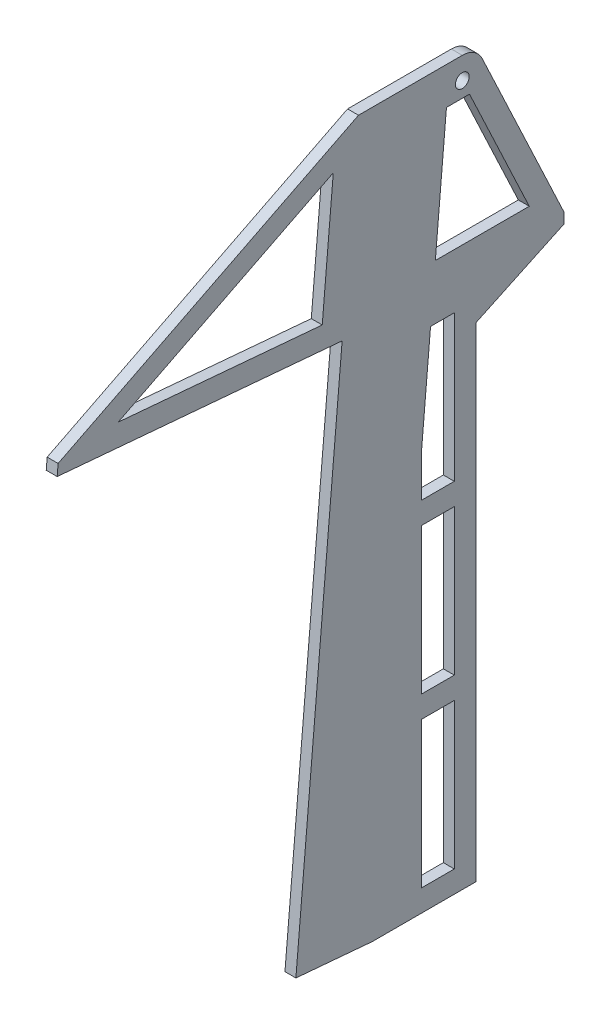
ISO-10303-21;
HEADER;
FILE_DESCRIPTION(('STEP AP214'),'2;1');
FILE_NAME('part.step','',(''),(''),'','','');
FILE_SCHEMA(('AUTOMOTIVE_DESIGN { 1 0 10303 214 1 1 1 1 }'));
ENDSEC;
DATA;
#1=APPLICATION_CONTEXT('core data for automotive mechanical design processes');
#2=APPLICATION_PROTOCOL_DEFINITION('international standard','automotive_design',2000,#1);
#3=PRODUCT_CONTEXT('',#1,'mechanical');
#4=PRODUCT('Part','Part','',(#3));
#5=PRODUCT_RELATED_PRODUCT_CATEGORY('part','',(#4));
#6=PRODUCT_DEFINITION_FORMATION('','',#4);
#7=PRODUCT_DEFINITION_CONTEXT('part definition',#1,'design');
#8=PRODUCT_DEFINITION('design','',#6,#7);
#9=PRODUCT_DEFINITION_SHAPE('','',#8);
#10=(LENGTH_UNIT() NAMED_UNIT(*) SI_UNIT(.MILLI.,.METRE.));
#11=(NAMED_UNIT(*) PLANE_ANGLE_UNIT() SI_UNIT($,.RADIAN.));
#12=(NAMED_UNIT(*) SI_UNIT($,.STERADIAN.) SOLID_ANGLE_UNIT());
#13=UNCERTAINTY_MEASURE_WITH_UNIT(LENGTH_MEASURE(1.E-05),#10,'distance_accuracy_value','');
#14=(GEOMETRIC_REPRESENTATION_CONTEXT(3) GLOBAL_UNCERTAINTY_ASSIGNED_CONTEXT((#13)) GLOBAL_UNIT_ASSIGNED_CONTEXT((#10,
#11,#12)) REPRESENTATION_CONTEXT('',''));
#15=CARTESIAN_POINT('',(0.,0.,0.));
#16=DIRECTION('',(0.,0.,1.));
#17=DIRECTION('',(1.,0.,0.));
#18=AXIS2_PLACEMENT_3D('',#15,#16,#17);
#19=CARTESIAN_POINT('',(6.35,419.1,-36.6664988837163));
#20=DIRECTION('',(0.,-1.,0.));
#21=DIRECTION('',(0.,0.,-1.));
#22=AXIS2_PLACEMENT_3D('',#19,#20,#21);
#23=PLANE('',#22);
#24=DIRECTION('',(0.,0.,1.));
#25=VECTOR('',#24,1.);
#26=CARTESIAN_POINT('',(6.35,419.1,-36.6664988837163));
#27=LINE('',#26,#25);
#28=CARTESIAN_POINT('',(6.35,419.1,-96.8631173548475));
#29=VERTEX_POINT('',#28);
#30=CARTESIAN_POINT('',(6.35,419.1,-36.6664988837163));
#31=VERTEX_POINT('',#30);
#32=EDGE_CURVE('E417',#29,#31,#27,.T.);
#33=ORIENTED_EDGE('',*,*,#32,.F.);
#34=DIRECTION('',(-1.,0.,0.));
#35=VECTOR('',#34,1.);
#36=CARTESIAN_POINT('',(6.35,419.1,-96.8631173548475));
#37=LINE('',#36,#35);
#38=CARTESIAN_POINT('',(0.,419.1,-96.8631173548475));
#39=VERTEX_POINT('',#38);
#40=EDGE_CURVE('E490',#29,#39,#37,.T.);
#41=ORIENTED_EDGE('',*,*,#40,.T.);
#42=DIRECTION('',(0.,0.,1.));
#43=VECTOR('',#42,1.);
#44=CARTESIAN_POINT('',(0.,419.1,-36.6664988837163));
#45=LINE('',#44,#43);
#46=CARTESIAN_POINT('',(0.,419.1,-36.6664988837163));
#47=VERTEX_POINT('',#46);
#48=EDGE_CURVE('E412',#39,#47,#45,.T.);
#49=ORIENTED_EDGE('',*,*,#48,.T.);
#50=DIRECTION('',(-1.,0.,0.));
#51=VECTOR('',#50,1.);
#52=CARTESIAN_POINT('',(6.35,419.1,-36.6664988837163));
#53=LINE('',#52,#51);
#54=EDGE_CURVE('E487',#31,#47,#53,.T.);
#55=ORIENTED_EDGE('',*,*,#54,.F.);
#56=EDGE_LOOP('',(#33,#41,#49,#55));
#57=FACE_BOUND('',#56,.T.);
#58=ADVANCED_FACE('F32',(#57),#23,.F.);
#59=CARTESIAN_POINT('',(6.35,331.297262379926,137.563755828843));
#60=DIRECTION('',(0.,-0.893013015148834,-0.450030837582036));
#61=DIRECTION('',(0.,0.450030837582036,-0.893013015148834));
#62=AXIS2_PLACEMENT_3D('',#59,#60,#61);
#63=PLANE('',#62);
#64=DIRECTION('',(0.,-0.450030837582036,0.893013015148834));
#65=VECTOR('',#64,1.);
#66=CARTESIAN_POINT('',(0.,331.297262379926,137.563755828843));
#67=LINE('',#66,#65);
#68=CARTESIAN_POINT('',(0.,331.297262379926,137.563755828843));
#69=VERTEX_POINT('',#68);
#70=EDGE_CURVE('E442',#47,#69,#67,.T.);
#71=ORIENTED_EDGE('',*,*,#70,.T.);
#72=DIRECTION('',(-1.,0.,0.));
#73=VECTOR('',#72,1.);
#74=CARTESIAN_POINT('',(6.35,331.297262379926,137.563755828843));
#75=LINE('',#74,#73);
#76=CARTESIAN_POINT('',(6.35,331.297262379926,137.563755828843));
#77=VERTEX_POINT('',#76);
#78=EDGE_CURVE('E484',#77,#69,#75,.T.);
#79=ORIENTED_EDGE('',*,*,#78,.F.);
#80=DIRECTION('',(0.,-0.450030837582036,0.893013015148834));
#81=VECTOR('',#80,1.);
#82=CARTESIAN_POINT('',(6.35,331.297262379926,137.563755828843));
#83=LINE('',#82,#81);
#84=EDGE_CURVE('E419',#31,#77,#83,.T.);
#85=ORIENTED_EDGE('',*,*,#84,.F.);
#86=ORIENTED_EDGE('',*,*,#54,.T.);
#87=EDGE_LOOP('',(#71,#79,#85,#86));
#88=FACE_BOUND('',#87,.T.);
#89=ADVANCED_FACE('F505',(#88),#63,.F.);
#90=CARTESIAN_POINT('',(6.35,324.971426047043,138.11719479529));
#91=DIRECTION('',(0.,-0.0871557427476588,-0.996194698091746));
#92=DIRECTION('',(0.,0.996194698091745,-0.0871557427476588));
#93=AXIS2_PLACEMENT_3D('',#90,#91,#92);
#94=PLANE('',#93);
#95=DIRECTION('',(0.,-0.996194698091745,0.0871557427476588));
#96=VECTOR('',#95,1.);
#97=CARTESIAN_POINT('',(0.,324.971426047043,138.11719479529));
#98=LINE('',#97,#96);
#99=CARTESIAN_POINT('',(0.,324.971426047043,138.11719479529));
#100=VERTEX_POINT('',#99);
#101=EDGE_CURVE('E444',#69,#100,#98,.T.);
#102=ORIENTED_EDGE('',*,*,#101,.T.);
#103=DIRECTION('',(-1.,0.,0.));
#104=VECTOR('',#103,1.);
#105=CARTESIAN_POINT('',(6.35,324.971426047043,138.11719479529));
#106=LINE('',#105,#104);
#107=CARTESIAN_POINT('',(6.35,324.971426047043,138.11719479529));
#108=VERTEX_POINT('',#107);
#109=EDGE_CURVE('E481',#108,#100,#106,.T.);
#110=ORIENTED_EDGE('',*,*,#109,.F.);
#111=DIRECTION('',(0.,-0.996194698091745,0.0871557427476588));
#112=VECTOR('',#111,1.);
#113=CARTESIAN_POINT('',(6.35,324.971426047043,138.11719479529));
#114=LINE('',#113,#112);
#115=EDGE_CURVE('E422',#77,#108,#114,.T.);
#116=ORIENTED_EDGE('',*,*,#115,.F.);
#117=ORIENTED_EDGE('',*,*,#78,.T.);
#118=EDGE_LOOP('',(#102,#110,#116,#117));
#119=FACE_BOUND('',#118,.T.);
#120=ADVANCED_FACE('F524',(#119),#94,.F.);
#121=CARTESIAN_POINT('',(6.35,324.971426047043,138.11719479529));
#122=DIRECTION('',(0.,0.996194698091745,-0.0871557427476613));
#123=DIRECTION('',(0.,0.0871557427476614,0.996194698091745));
#124=AXIS2_PLACEMENT_3D('',#121,#122,#123);
#125=PLANE('',#124);
#126=DIRECTION('',(0.,-0.0871557427476613,-0.996194698091745));
#127=VECTOR('',#126,1.);
#128=CARTESIAN_POINT('',(0.,324.971426047043,138.11719479529));
#129=LINE('',#128,#127);
#130=CARTESIAN_POINT('',(0.,310.511003372466,-27.1661926951519));
#131=VERTEX_POINT('',#130);
#132=EDGE_CURVE('E446',#100,#131,#129,.T.);
#133=ORIENTED_EDGE('',*,*,#132,.T.);
#134=DIRECTION('',(-1.,0.,0.));
#135=VECTOR('',#134,1.);
#136=CARTESIAN_POINT('',(6.35,310.511003372466,-27.1661926951519));
#137=LINE('',#136,#135);
#138=CARTESIAN_POINT('',(6.35,310.511003372466,-27.1661926951519));
#139=VERTEX_POINT('',#138);
#140=EDGE_CURVE('E478',#139,#131,#137,.T.);
#141=ORIENTED_EDGE('',*,*,#140,.F.);
#142=DIRECTION('',(0.,-0.0871557427476613,-0.996194698091745));
#143=VECTOR('',#142,1.);
#144=CARTESIAN_POINT('',(6.35,324.971426047043,138.11719479529));
#145=LINE('',#144,#143);
#146=EDGE_CURVE('E424',#108,#139,#145,.T.);
#147=ORIENTED_EDGE('',*,*,#146,.F.);
#148=ORIENTED_EDGE('',*,*,#109,.T.);
#149=EDGE_LOOP('',(#133,#141,#147,#148));
#150=FACE_BOUND('',#149,.T.);
#151=ADVANCED_FACE('F529',(#150),#125,.F.);
#152=CARTESIAN_POINT('',(6.35,310.511003372466,-27.1661926951519));
#153=DIRECTION('',(0.,-0.0871557427476619,-0.996194698091745));
#154=DIRECTION('',(0.,0.996194698091745,-0.0871557427476619));
#155=AXIS2_PLACEMENT_3D('',#152,#153,#154);
#156=PLANE('',#155);
#157=DIRECTION('',(0.,-0.996194698091745,0.0871557427476619));
#158=VECTOR('',#157,1.);
#159=CARTESIAN_POINT('',(0.,310.511003372466,-27.1661926951519));
#160=LINE('',#159,#158);
#161=CARTESIAN_POINT('',(0.,3.8740727651336,-0.338937448623741));
#162=VERTEX_POINT('',#161);
#163=EDGE_CURVE('E448',#131,#162,#160,.T.);
#164=ORIENTED_EDGE('',*,*,#163,.T.);
#165=DIRECTION('',(-1.,0.,0.));
#166=VECTOR('',#165,1.);
#167=CARTESIAN_POINT('',(6.35,3.8740727651336,-0.338937448623741));
#168=LINE('',#167,#166);
#169=CARTESIAN_POINT('',(6.35,3.8740727651336,-0.338937448623741));
#170=VERTEX_POINT('',#169);
#171=EDGE_CURVE('E475',#170,#162,#168,.T.);
#172=ORIENTED_EDGE('',*,*,#171,.F.);
#173=DIRECTION('',(0.,-0.996194698091745,0.0871557427476619));
#174=VECTOR('',#173,1.);
#175=CARTESIAN_POINT('',(6.35,310.511003372466,-27.1661926951519));
#176=LINE('',#175,#174);
#177=EDGE_CURVE('E426',#139,#170,#176,.T.);
#178=ORIENTED_EDGE('',*,*,#177,.F.);
#179=ORIENTED_EDGE('',*,*,#140,.T.);
#180=EDGE_LOOP('',(#164,#172,#178,#179));
#181=FACE_BOUND('',#180,.T.);
#182=ADVANCED_FACE('F533',(#181),#156,.F.);
#183=CARTESIAN_POINT('',(6.35,3.8740727651336,-0.338937448623741));
#184=DIRECTION('',(0.,0.996194698091745,-0.087155742747662));
#185=DIRECTION('',(0.,0.087155742747662,0.996194698091745));
#186=AXIS2_PLACEMENT_3D('',#183,#184,#185);
#187=PLANE('',#186);
#188=DIRECTION('',(0.,-0.087155742747662,-0.996194698091745));
#189=VECTOR('',#188,1.);
#190=CARTESIAN_POINT('',(0.,3.8740727651336,-0.338937448623741));
#191=LINE('',#190,#189);
#192=CARTESIAN_POINT('',(0.,0.,-44.6197917788018));
#193=VERTEX_POINT('',#192);
#194=EDGE_CURVE('E450',#162,#193,#191,.T.);
#195=ORIENTED_EDGE('',*,*,#194,.T.);
#196=DIRECTION('',(-1.,0.,0.));
#197=VECTOR('',#196,1.);
#198=CARTESIAN_POINT('',(6.35,0.,-44.6197917788018));
#199=LINE('',#198,#197);
#200=CARTESIAN_POINT('',(6.35,0.,-44.6197917788018));
#201=VERTEX_POINT('',#200);
#202=EDGE_CURVE('E472',#201,#193,#199,.T.);
#203=ORIENTED_EDGE('',*,*,#202,.F.);
#204=DIRECTION('',(0.,-0.087155742747662,-0.996194698091745));
#205=VECTOR('',#204,1.);
#206=CARTESIAN_POINT('',(6.35,3.8740727651336,-0.338937448623741));
#207=LINE('',#206,#205);
#208=EDGE_CURVE('E428',#170,#201,#207,.T.);
#209=ORIENTED_EDGE('',*,*,#208,.F.);
#210=ORIENTED_EDGE('',*,*,#171,.T.);
#211=EDGE_LOOP('',(#195,#203,#209,#210));
#212=FACE_BOUND('',#211,.T.);
#213=ADVANCED_FACE('F537',(#212),#187,.F.);
#214=CARTESIAN_POINT('',(6.35,0.,-44.6197917788018));
#215=DIRECTION('',(0.,1.,0.));
#216=DIRECTION('',(0.,0.,1.));
#217=AXIS2_PLACEMENT_3D('',#214,#215,#216);
#218=PLANE('',#217);
#219=DIRECTION('',(0.,0.,-1.));
#220=VECTOR('',#219,1.);
#221=CARTESIAN_POINT('',(0.,0.,-44.6197917788018));
#222=LINE('',#221,#220);
#223=CARTESIAN_POINT('',(0.,0.,-104.922607748748));
#224=VERTEX_POINT('',#223);
#225=EDGE_CURVE('E452',#193,#224,#222,.T.);
#226=ORIENTED_EDGE('',*,*,#225,.T.);
#227=DIRECTION('',(-1.,0.,0.));
#228=VECTOR('',#227,1.);
#229=CARTESIAN_POINT('',(6.35,0.,-104.922607748748));
#230=LINE('',#229,#228);
#231=CARTESIAN_POINT('',(6.35,0.,-104.922607748748));
#232=VERTEX_POINT('',#231);
#233=EDGE_CURVE('E469',#232,#224,#230,.T.);
#234=ORIENTED_EDGE('',*,*,#233,.F.);
#235=DIRECTION('',(0.,0.,-1.));
#236=VECTOR('',#235,1.);
#237=CARTESIAN_POINT('',(6.35,0.,-44.6197917788018));
#238=LINE('',#237,#236);
#239=EDGE_CURVE('E430',#201,#232,#238,.T.);
#240=ORIENTED_EDGE('',*,*,#239,.F.);
#241=ORIENTED_EDGE('',*,*,#202,.T.);
#242=EDGE_LOOP('',(#226,#234,#240,#241));
#243=FACE_BOUND('',#242,.T.);
#244=ADVANCED_FACE('F541',(#243),#218,.F.);
#245=CARTESIAN_POINT('',(6.35,280.894117647059,-104.922607748748));
#246=DIRECTION('',(0.,0.,1.));
#247=DIRECTION('',(0.,-1.,0.));
#248=AXIS2_PLACEMENT_3D('',#245,#246,#247);
#249=PLANE('',#248);
#250=DIRECTION('',(0.,1.,0.));
#251=VECTOR('',#250,1.);
#252=CARTESIAN_POINT('',(0.,280.894117647059,-104.922607748748));
#253=LINE('',#252,#251);
#254=CARTESIAN_POINT('',(0.,280.894117647059,-104.922607748748));
#255=VERTEX_POINT('',#254);
#256=EDGE_CURVE('E454',#224,#255,#253,.T.);
#257=ORIENTED_EDGE('',*,*,#256,.T.);
#258=DIRECTION('',(-1.,0.,0.));
#259=VECTOR('',#258,1.);
#260=CARTESIAN_POINT('',(6.35,280.894117647059,-104.922607748748));
#261=LINE('',#260,#259);
#262=CARTESIAN_POINT('',(6.35,280.894117647059,-104.922607748748));
#263=VERTEX_POINT('',#262);
#264=EDGE_CURVE('E466',#263,#255,#261,.T.);
#265=ORIENTED_EDGE('',*,*,#264,.F.);
#266=DIRECTION('',(0.,1.,0.));
#267=VECTOR('',#266,1.);
#268=CARTESIAN_POINT('',(6.35,280.894117647059,-104.922607748748));
#269=LINE('',#268,#267);
#270=EDGE_CURVE('E432',#232,#263,#269,.T.);
#271=ORIENTED_EDGE('',*,*,#270,.F.);
#272=ORIENTED_EDGE('',*,*,#233,.T.);
#273=EDGE_LOOP('',(#257,#265,#271,#272));
#274=FACE_BOUND('',#273,.T.);
#275=ADVANCED_FACE('F545',(#274),#249,.F.);
#276=CARTESIAN_POINT('',(6.35,304.8,-155.722607748748));
#277=DIRECTION('',(0.,0.904818702200994,0.425797036329879));
#278=DIRECTION('',(0.,-0.425797036329879,0.904818702200994));
#279=AXIS2_PLACEMENT_3D('',#276,#277,#278);
#280=PLANE('',#279);
#281=DIRECTION('',(0.,0.42579703632988,-0.904818702200994));
#282=VECTOR('',#281,1.);
#283=CARTESIAN_POINT('',(0.,304.8,-155.722607748748));
#284=LINE('',#283,#282);
#285=CARTESIAN_POINT('',(0.,304.8,-155.722607748748));
#286=VERTEX_POINT('',#285);
#287=EDGE_CURVE('E456',#255,#286,#284,.T.);
#288=ORIENTED_EDGE('',*,*,#287,.T.);
#289=DIRECTION('',(-1.,0.,0.));
#290=VECTOR('',#289,1.);
#291=CARTESIAN_POINT('',(6.35,304.8,-155.722607748748));
#292=LINE('',#291,#290);
#293=CARTESIAN_POINT('',(6.35,304.8,-155.722607748748));
#294=VERTEX_POINT('',#293);
#295=EDGE_CURVE('E463',#294,#286,#292,.T.);
#296=ORIENTED_EDGE('',*,*,#295,.F.);
#297=DIRECTION('',(0.,0.42579703632988,-0.904818702200994));
#298=VECTOR('',#297,1.);
#299=CARTESIAN_POINT('',(6.35,304.8,-155.722607748748));
#300=LINE('',#299,#298);
#301=EDGE_CURVE('E434',#263,#294,#300,.T.);
#302=ORIENTED_EDGE('',*,*,#301,.F.);
#303=ORIENTED_EDGE('',*,*,#264,.T.);
#304=EDGE_LOOP('',(#288,#296,#302,#303));
#305=FACE_BOUND('',#304,.T.);
#306=ADVANCED_FACE('F549',(#305),#280,.F.);
#307=CARTESIAN_POINT('',(6.35,311.15,-155.722607748748));
#308=DIRECTION('',(0.,0.,1.));
#309=DIRECTION('',(1.,0.,0.));
#310=AXIS2_PLACEMENT_3D('',#307,#308,#309);
#311=PLANE('',#310);
#312=DIRECTION('',(0.,1.,0.));
#313=VECTOR('',#312,1.);
#314=CARTESIAN_POINT('',(0.,311.15,-155.722607748748));
#315=LINE('',#314,#313);
#316=CARTESIAN_POINT('',(0.,311.15,-155.722607748748));
#317=VERTEX_POINT('',#316);
#318=EDGE_CURVE('E458',#286,#317,#315,.T.);
#319=ORIENTED_EDGE('',*,*,#318,.T.);
#320=DIRECTION('',(-1.,0.,0.));
#321=VECTOR('',#320,1.);
#322=CARTESIAN_POINT('',(6.35,311.15,-155.722607748748));
#323=LINE('',#322,#321);
#324=CARTESIAN_POINT('',(6.35,311.15,-155.722607748748));
#325=VERTEX_POINT('',#324);
#326=EDGE_CURVE('E440',#325,#317,#323,.T.);
#327=ORIENTED_EDGE('',*,*,#326,.F.);
#328=DIRECTION('',(0.,1.,0.));
#329=VECTOR('',#328,1.);
#330=CARTESIAN_POINT('',(6.35,311.15,-155.722607748748));
#331=LINE('',#330,#329);
#332=EDGE_CURVE('E436',#294,#325,#331,.T.);
#333=ORIENTED_EDGE('',*,*,#332,.F.);
#334=ORIENTED_EDGE('',*,*,#295,.T.);
#335=EDGE_LOOP('',(#319,#327,#333,#334));
#336=FACE_BOUND('',#335,.T.);
#337=ADVANCED_FACE('F553',(#336),#311,.F.);
#338=CARTESIAN_POINT('',(6.35,419.1,-104.922607748748));
#339=DIRECTION('',(0.,-0.42579703632988,0.904818702200994));
#340=DIRECTION('',(0.,-0.904818702200994,-0.42579703632988));
#341=AXIS2_PLACEMENT_3D('',#338,#339,#340);
#342=PLANE('',#341);
#343=DIRECTION('',(0.,0.904818702200994,0.42579703632988));
#344=VECTOR('',#343,1.);
#345=CARTESIAN_POINT('',(0.,419.1,-104.922607748748));
#346=LINE('',#345,#344);
#347=CARTESIAN_POINT('',(0.,411.807622361389,-108.3543148728));
#348=VERTEX_POINT('',#347);
#349=EDGE_CURVE('E420',#317,#348,#346,.T.);
#350=ORIENTED_EDGE('',*,*,#349,.T.);
#351=DIRECTION('',(-1.,0.,0.));
#352=VECTOR('',#351,1.);
#353=CARTESIAN_POINT('',(6.35,411.807622361389,-108.3543148728));
#354=LINE('',#353,#352);
#355=CARTESIAN_POINT('',(6.35,411.807622361389,-108.3543148728));
#356=VERTEX_POINT('',#355);
#357=EDGE_CURVE('E40',#348,#356,#354,.F.);
#358=ORIENTED_EDGE('',*,*,#357,.T.);
#359=DIRECTION('',(0.,0.904818702200994,0.42579703632988));
#360=VECTOR('',#359,1.);
#361=CARTESIAN_POINT('',(6.35,419.1,-104.922607748748));
#362=LINE('',#361,#360);
#363=EDGE_CURVE('E438',#325,#356,#362,.T.);
#364=ORIENTED_EDGE('',*,*,#363,.F.);
#365=ORIENTED_EDGE('',*,*,#326,.T.);
#366=EDGE_LOOP('',(#350,#358,#364,#365));
#367=FACE_BOUND('',#366,.T.);
#368=ADVANCED_FACE('F557',(#367),#342,.F.);
#369=CARTESIAN_POINT('',(6.35,0.,0.));
#370=DIRECTION('',(-1.,0.,0.));
#371=DIRECTION('',(0.,0.,1.));
#372=AXIS2_PLACEMENT_3D('',#369,#370,#371);
#373=PLANE('',#372);
#374=CARTESIAN_POINT('',(6.35,406.4,-96.8631173548475));
#375=DIRECTION('',(1.,0.,0.));
#376=DIRECTION('',(0.,0.,-1.));
#377=AXIS2_PLACEMENT_3D('',#374,#375,#376);
#378=CIRCLE('',#377,4.00000000000001);
#379=CARTESIAN_POINT('',(6.35,406.4,-100.863117354848));
#380=VERTEX_POINT('',#379);
#381=EDGE_CURVE('E272',#380,#380,#378,.T.);
#382=ORIENTED_EDGE('',*,*,#381,.F.);
#383=EDGE_LOOP('',(#382));
#384=FACE_BOUND('',#383,.T.);
#385=DIRECTION('',(0.,-0.996194698091745,0.0871557427476616));
#386=VECTOR('',#385,1.);
#387=CARTESIAN_POINT('',(6.35,397.501651207452,-87.6781936520239));
#388=LINE('',#387,#386);
#389=CARTESIAN_POINT('',(6.35,397.501651207452,-87.6781936520239));
#390=VERTEX_POINT('',#389);
#391=CARTESIAN_POINT('',(6.35,323.85,-81.2345091214061));
#392=VERTEX_POINT('',#391);
#393=EDGE_CURVE('E278',#390,#392,#388,.T.);
#394=ORIENTED_EDGE('',*,*,#393,.F.);
#395=DIRECTION('',(0.,0.,1.));
#396=VECTOR('',#395,1.);
#397=CARTESIAN_POINT('',(6.35,397.501651207452,-101.050575610164));
#398=LINE('',#397,#396);
#399=CARTESIAN_POINT('',(6.35,397.501651207452,-101.050575610164));
#400=VERTEX_POINT('',#399);
#401=EDGE_CURVE('E248',#400,#390,#398,.T.);
#402=ORIENTED_EDGE('',*,*,#401,.F.);
#403=DIRECTION('',(0.,0.904818702200994,0.42579703632988));
#404=VECTOR('',#403,1.);
#405=CARTESIAN_POINT('',(6.35,323.85,-135.710176178377));
#406=LINE('',#405,#404);
#407=CARTESIAN_POINT('',(6.35,323.85,-135.710176178377));
#408=VERTEX_POINT('',#407);
#409=EDGE_CURVE('E266',#408,#400,#406,.T.);
#410=ORIENTED_EDGE('',*,*,#409,.F.);
#411=DIRECTION('',(0.,0.,-1.));
#412=VECTOR('',#411,1.);
#413=CARTESIAN_POINT('',(6.35,323.85,-81.2345091214061));
#414=LINE('',#413,#412);
#415=EDGE_CURVE('E269',#392,#408,#414,.T.);
#416=ORIENTED_EDGE('',*,*,#415,.F.);
#417=EDGE_LOOP('',(#394,#402,#410,#416));
#418=FACE_BOUND('',#417,.T.);
#419=DIRECTION('',(0.,-1.,0.));
#420=VECTOR('',#419,1.);
#421=CARTESIAN_POINT('',(6.35,12.7,-73.1726077487484));
#422=LINE('',#421,#420);
#423=CARTESIAN_POINT('',(6.35,97.3666666666667,-73.1726077487484));
#424=VERTEX_POINT('',#423);
#425=CARTESIAN_POINT('',(6.35,12.7,-73.1726077487484));
#426=VERTEX_POINT('',#425);
#427=EDGE_CURVE('E304',#424,#426,#422,.T.);
#428=ORIENTED_EDGE('',*,*,#427,.F.);
#429=DIRECTION('',(0.,0.,1.));
#430=VECTOR('',#429,1.);
#431=CARTESIAN_POINT('',(6.35,97.3666666666667,-73.1726077487484));
#432=LINE('',#431,#430);
#433=CARTESIAN_POINT('',(6.35,97.3666666666667,-92.2226077487481));
#434=VERTEX_POINT('',#433);
#435=EDGE_CURVE('E285',#434,#424,#432,.T.);
#436=ORIENTED_EDGE('',*,*,#435,.F.);
#437=DIRECTION('',(0.,1.,0.));
#438=VECTOR('',#437,1.);
#439=CARTESIAN_POINT('',(6.35,97.3666666666667,-92.2226077487481));
#440=LINE('',#439,#438);
#441=CARTESIAN_POINT('',(6.35,12.7,-92.2226077487482));
#442=VERTEX_POINT('',#441);
#443=EDGE_CURVE('E293',#442,#434,#440,.T.);
#444=ORIENTED_EDGE('',*,*,#443,.F.);
#445=DIRECTION('',(0.,0.,-1.));
#446=VECTOR('',#445,1.);
#447=CARTESIAN_POINT('',(6.35,12.7,-92.2226077487482));
#448=LINE('',#447,#446);
#449=EDGE_CURVE('E307',#426,#442,#448,.T.);
#450=ORIENTED_EDGE('',*,*,#449,.F.);
#451=EDGE_LOOP('',(#428,#436,#444,#450));
#452=FACE_BOUND('',#451,.T.);
#453=DIRECTION('',(0.,-1.,0.));
#454=VECTOR('',#453,1.);
#455=CARTESIAN_POINT('',(6.35,110.066666666667,-73.1726077487484));
#456=LINE('',#455,#454);
#457=CARTESIAN_POINT('',(6.35,194.733333333333,-73.1726077487484));
#458=VERTEX_POINT('',#457);
#459=CARTESIAN_POINT('',(6.35,110.066666666667,-73.1726077487484));
#460=VERTEX_POINT('',#459);
#461=EDGE_CURVE('E336',#458,#460,#456,.T.);
#462=ORIENTED_EDGE('',*,*,#461,.F.);
#463=DIRECTION('',(0.,0.,1.));
#464=VECTOR('',#463,1.);
#465=CARTESIAN_POINT('',(6.35,194.733333333333,-73.1726077487484));
#466=LINE('',#465,#464);
#467=CARTESIAN_POINT('',(6.35,194.733333333333,-92.2226077487481));
#468=VERTEX_POINT('',#467);
#469=EDGE_CURVE('E314',#468,#458,#466,.T.);
#470=ORIENTED_EDGE('',*,*,#469,.F.);
#471=DIRECTION('',(0.,1.,0.));
#472=VECTOR('',#471,1.);
#473=CARTESIAN_POINT('',(6.35,194.733333333333,-92.2226077487481));
#474=LINE('',#473,#472);
#475=CARTESIAN_POINT('',(6.35,110.066666666667,-92.2226077487481));
#476=VERTEX_POINT('',#475);
#477=EDGE_CURVE('E325',#476,#468,#474,.T.);
#478=ORIENTED_EDGE('',*,*,#477,.F.);
#479=DIRECTION('',(0.,0.,-1.));
#480=VECTOR('',#479,1.);
#481=CARTESIAN_POINT('',(6.35,110.066666666667,-92.2226077487481));
#482=LINE('',#481,#480);
#483=EDGE_CURVE('E339',#460,#476,#482,.T.);
#484=ORIENTED_EDGE('',*,*,#483,.F.);
#485=EDGE_LOOP('',(#462,#470,#478,#484));
#486=FACE_BOUND('',#485,.T.);
#487=DIRECTION('',(0.,-0.996194698091745,0.0871557427476619));
#488=VECTOR('',#487,1.);
#489=CARTESIAN_POINT('',(6.35,292.1,-78.4567440544579));
#490=LINE('',#489,#488);
#491=CARTESIAN_POINT('',(6.35,292.1,-78.4567440544579));
#492=VERTEX_POINT('',#491);
#493=CARTESIAN_POINT('',(6.35,231.702045650823,-73.1726077487484));
#494=VERTEX_POINT('',#493);
#495=EDGE_CURVE('E371',#492,#494,#490,.T.);
#496=ORIENTED_EDGE('',*,*,#495,.F.);
#497=DIRECTION('',(0.,0.,1.));
#498=VECTOR('',#497,1.);
#499=CARTESIAN_POINT('',(6.35,292.1,-92.2226077487481));
#500=LINE('',#499,#498);
#501=CARTESIAN_POINT('',(6.35,292.1,-92.2226077487481));
#502=VERTEX_POINT('',#501);
#503=EDGE_CURVE('E346',#502,#492,#500,.T.);
#504=ORIENTED_EDGE('',*,*,#503,.F.);
#505=DIRECTION('',(0.,1.,0.));
#506=VECTOR('',#505,1.);
#507=CARTESIAN_POINT('',(6.35,207.433333333333,-92.2226077487481));
#508=LINE('',#507,#506);
#509=CARTESIAN_POINT('',(6.35,207.433333333333,-92.2226077487481));
#510=VERTEX_POINT('',#509);
#511=EDGE_CURVE('E357',#510,#502,#508,.T.);
#512=ORIENTED_EDGE('',*,*,#511,.F.);
#513=DIRECTION('',(0.,0.,-1.));
#514=VECTOR('',#513,1.);
#515=CARTESIAN_POINT('',(6.35,207.433333333333,-73.1726077487484));
#516=LINE('',#515,#514);
#517=CARTESIAN_POINT('',(6.35,207.433333333333,-73.1726077487484));
#518=VERTEX_POINT('',#517);
#519=EDGE_CURVE('E377',#518,#510,#516,.T.);
#520=ORIENTED_EDGE('',*,*,#519,.F.);
#521=DIRECTION('',(0.,-1.,0.));
#522=VECTOR('',#521,1.);
#523=CARTESIAN_POINT('',(6.35,231.702045650823,-73.1726077487484));
#524=LINE('',#523,#522);
#525=EDGE_CURVE('E374',#494,#518,#524,.T.);
#526=ORIENTED_EDGE('',*,*,#525,.F.);
#527=EDGE_LOOP('',(#496,#504,#512,#520,#526));
#528=FACE_BOUND('',#527,.T.);
#529=DIRECTION('',(0.,0.996194698091745,-0.087155742747662));
#530=VECTOR('',#529,1.);
#531=CARTESIAN_POINT('',(6.35,397.501651207452,-22.028376276689));
#532=LINE('',#531,#530);
#533=CARTESIAN_POINT('',(6.35,324.269553971127,-15.6213979622821));
#534=VERTEX_POINT('',#533);
#535=CARTESIAN_POINT('',(6.35,397.501651207452,-22.028376276689));
#536=VERTEX_POINT('',#535);
#537=EDGE_CURVE('E405',#534,#536,#532,.T.);
#538=ORIENTED_EDGE('',*,*,#537,.F.);
#539=DIRECTION('',(0.,-0.0871557427476612,-0.996194698091745));
#540=VECTOR('',#539,1.);
#541=CARTESIAN_POINT('',(6.35,324.269553971127,-15.6213979622821));
#542=LINE('',#541,#540);
#543=CARTESIAN_POINT('',(6.35,334.624867422538,102.740376398826));
#544=VERTEX_POINT('',#543);
#545=EDGE_CURVE('E384',#544,#534,#542,.T.);
#546=ORIENTED_EDGE('',*,*,#545,.F.);
#547=DIRECTION('',(0.,-0.450030837582036,0.893013015148834));
#548=VECTOR('',#547,1.);
#549=CARTESIAN_POINT('',(6.35,334.624867422538,102.740376398826));
#550=LINE('',#549,#548);
#551=EDGE_CURVE('E397',#536,#544,#550,.T.);
#552=ORIENTED_EDGE('',*,*,#551,.F.);
#553=EDGE_LOOP('',(#538,#546,#552));
#554=FACE_BOUND('',#553,.T.);
#555=ORIENTED_EDGE('',*,*,#363,.T.);
#556=CARTESIAN_POINT('',(6.35,406.4,-96.8631173548475));
#557=DIRECTION('',(-1.,0.,0.));
#558=DIRECTION('',(0.,0.,1.));
#559=AXIS2_PLACEMENT_3D('',#556,#557,#558);
#560=CIRCLE('',#559,12.7);
#561=EDGE_CURVE('E11',#356,#29,#560,.F.);
#562=ORIENTED_EDGE('',*,*,#561,.T.);
#563=ORIENTED_EDGE('',*,*,#32,.T.);
#564=ORIENTED_EDGE('',*,*,#84,.T.);
#565=ORIENTED_EDGE('',*,*,#115,.T.);
#566=ORIENTED_EDGE('',*,*,#146,.T.);
#567=ORIENTED_EDGE('',*,*,#177,.T.);
#568=ORIENTED_EDGE('',*,*,#208,.T.);
#569=ORIENTED_EDGE('',*,*,#239,.T.);
#570=ORIENTED_EDGE('',*,*,#270,.T.);
#571=ORIENTED_EDGE('',*,*,#301,.T.);
#572=ORIENTED_EDGE('',*,*,#332,.T.);
#573=EDGE_LOOP('',(#555,#562,#563,#564,#565,#566,#567,#568,#569,#570,#571,#572));
#574=FACE_BOUND('',#573,.T.);
#575=ADVANCED_FACE('F508',(#384,#418,#452,#486,#528,#554,#574),#373,.F.);
#576=CARTESIAN_POINT('',(0.,0.,0.));
#577=DIRECTION('',(-1.,0.,0.));
#578=DIRECTION('',(0.,0.,1.));
#579=AXIS2_PLACEMENT_3D('',#576,#577,#578);
#580=PLANE('',#579);
#581=CARTESIAN_POINT('',(0.,406.4,-96.8631173548475));
#582=DIRECTION('',(1.,0.,0.));
#583=DIRECTION('',(0.,0.,-1.));
#584=AXIS2_PLACEMENT_3D('',#581,#582,#583);
#585=CIRCLE('',#584,4.00000000000001);
#586=CARTESIAN_POINT('',(0.,406.4,-100.863117354848));
#587=VERTEX_POINT('',#586);
#588=EDGE_CURVE('E279',#587,#587,#585,.T.);
#589=ORIENTED_EDGE('',*,*,#588,.T.);
#590=EDGE_LOOP('',(#589));
#591=FACE_BOUND('',#590,.T.);
#592=DIRECTION('',(0.,0.,1.));
#593=VECTOR('',#592,1.);
#594=CARTESIAN_POINT('',(0.,397.501651207452,-101.050575610164));
#595=LINE('',#594,#593);
#596=CARTESIAN_POINT('',(0.,397.501651207452,-101.050575610164));
#597=VERTEX_POINT('',#596);
#598=CARTESIAN_POINT('',(0.,397.501651207452,-87.6781936520239));
#599=VERTEX_POINT('',#598);
#600=EDGE_CURVE('E245',#597,#599,#595,.T.);
#601=ORIENTED_EDGE('',*,*,#600,.T.);
#602=DIRECTION('',(0.,-0.996194698091745,0.0871557427476616));
#603=VECTOR('',#602,1.);
#604=CARTESIAN_POINT('',(0.,397.501651207452,-87.6781936520239));
#605=LINE('',#604,#603);
#606=CARTESIAN_POINT('',(0.,323.85,-81.2345091214061));
#607=VERTEX_POINT('',#606);
#608=EDGE_CURVE('E257',#599,#607,#605,.T.);
#609=ORIENTED_EDGE('',*,*,#608,.T.);
#610=DIRECTION('',(0.,0.,-1.));
#611=VECTOR('',#610,1.);
#612=CARTESIAN_POINT('',(0.,323.85,-81.2345091214061));
#613=LINE('',#612,#611);
#614=CARTESIAN_POINT('',(0.,323.85,-135.710176178377));
#615=VERTEX_POINT('',#614);
#616=EDGE_CURVE('E261',#607,#615,#613,.T.);
#617=ORIENTED_EDGE('',*,*,#616,.T.);
#618=DIRECTION('',(0.,0.904818702200994,0.42579703632988));
#619=VECTOR('',#618,1.);
#620=CARTESIAN_POINT('',(0.,323.85,-135.710176178377));
#621=LINE('',#620,#619);
#622=EDGE_CURVE('E253',#615,#597,#621,.T.);
#623=ORIENTED_EDGE('',*,*,#622,.T.);
#624=EDGE_LOOP('',(#601,#609,#617,#623));
#625=FACE_BOUND('',#624,.T.);
#626=DIRECTION('',(0.,0.,1.));
#627=VECTOR('',#626,1.);
#628=CARTESIAN_POINT('',(0.,97.3666666666667,-73.1726077487484));
#629=LINE('',#628,#627);
#630=CARTESIAN_POINT('',(0.,97.3666666666667,-92.2226077487481));
#631=VERTEX_POINT('',#630);
#632=CARTESIAN_POINT('',(0.,97.3666666666667,-73.1726077487484));
#633=VERTEX_POINT('',#632);
#634=EDGE_CURVE('E289',#631,#633,#629,.T.);
#635=ORIENTED_EDGE('',*,*,#634,.T.);
#636=DIRECTION('',(0.,-1.,0.));
#637=VECTOR('',#636,1.);
#638=CARTESIAN_POINT('',(0.,12.7,-73.1726077487484));
#639=LINE('',#638,#637);
#640=CARTESIAN_POINT('',(0.,12.7,-73.1726077487484));
#641=VERTEX_POINT('',#640);
#642=EDGE_CURVE('E292',#633,#641,#639,.T.);
#643=ORIENTED_EDGE('',*,*,#642,.T.);
#644=DIRECTION('',(0.,0.,-1.));
#645=VECTOR('',#644,1.);
#646=CARTESIAN_POINT('',(0.,12.7,-92.2226077487482));
#647=LINE('',#646,#645);
#648=CARTESIAN_POINT('',(0.,12.7,-92.2226077487482));
#649=VERTEX_POINT('',#648);
#650=EDGE_CURVE('E296',#641,#649,#647,.T.);
#651=ORIENTED_EDGE('',*,*,#650,.T.);
#652=DIRECTION('',(0.,1.,0.));
#653=VECTOR('',#652,1.);
#654=CARTESIAN_POINT('',(0.,97.3666666666667,-92.2226077487481));
#655=LINE('',#654,#653);
#656=EDGE_CURVE('E299',#649,#631,#655,.T.);
#657=ORIENTED_EDGE('',*,*,#656,.T.);
#658=EDGE_LOOP('',(#635,#643,#651,#657));
#659=FACE_BOUND('',#658,.T.);
#660=DIRECTION('',(0.,0.,1.));
#661=VECTOR('',#660,1.);
#662=CARTESIAN_POINT('',(0.,194.733333333333,-73.1726077487484));
#663=LINE('',#662,#661);
#664=CARTESIAN_POINT('',(0.,194.733333333333,-92.2226077487481));
#665=VERTEX_POINT('',#664);
#666=CARTESIAN_POINT('',(0.,194.733333333333,-73.1726077487484));
#667=VERTEX_POINT('',#666);
#668=EDGE_CURVE('E321',#665,#667,#663,.T.);
#669=ORIENTED_EDGE('',*,*,#668,.T.);
#670=DIRECTION('',(0.,-1.,0.));
#671=VECTOR('',#670,1.);
#672=CARTESIAN_POINT('',(0.,110.066666666667,-73.1726077487484));
#673=LINE('',#672,#671);
#674=CARTESIAN_POINT('',(0.,110.066666666667,-73.1726077487484));
#675=VERTEX_POINT('',#674);
#676=EDGE_CURVE('E324',#667,#675,#673,.T.);
#677=ORIENTED_EDGE('',*,*,#676,.T.);
#678=DIRECTION('',(0.,0.,-1.));
#679=VECTOR('',#678,1.);
#680=CARTESIAN_POINT('',(0.,110.066666666667,-92.2226077487481));
#681=LINE('',#680,#679);
#682=CARTESIAN_POINT('',(0.,110.066666666667,-92.2226077487481));
#683=VERTEX_POINT('',#682);
#684=EDGE_CURVE('E328',#675,#683,#681,.T.);
#685=ORIENTED_EDGE('',*,*,#684,.T.);
#686=DIRECTION('',(0.,1.,0.));
#687=VECTOR('',#686,1.);
#688=CARTESIAN_POINT('',(0.,194.733333333333,-92.2226077487481));
#689=LINE('',#688,#687);
#690=EDGE_CURVE('E331',#683,#665,#689,.T.);
#691=ORIENTED_EDGE('',*,*,#690,.T.);
#692=EDGE_LOOP('',(#669,#677,#685,#691));
#693=FACE_BOUND('',#692,.T.);
#694=DIRECTION('',(0.,0.,1.));
#695=VECTOR('',#694,1.);
#696=CARTESIAN_POINT('',(0.,292.1,-92.2226077487481));
#697=LINE('',#696,#695);
#698=CARTESIAN_POINT('',(0.,292.1,-92.2226077487481));
#699=VERTEX_POINT('',#698);
#700=CARTESIAN_POINT('',(0.,292.1,-78.4567440544579));
#701=VERTEX_POINT('',#700);
#702=EDGE_CURVE('E353',#699,#701,#697,.T.);
#703=ORIENTED_EDGE('',*,*,#702,.T.);
#704=DIRECTION('',(0.,-0.996194698091745,0.0871557427476619));
#705=VECTOR('',#704,1.);
#706=CARTESIAN_POINT('',(0.,292.1,-78.4567440544579));
#707=LINE('',#706,#705);
#708=CARTESIAN_POINT('',(0.,231.702045650823,-73.1726077487484));
#709=VERTEX_POINT('',#708);
#710=EDGE_CURVE('E356',#701,#709,#707,.T.);
#711=ORIENTED_EDGE('',*,*,#710,.T.);
#712=DIRECTION('',(0.,-1.,0.));
#713=VECTOR('',#712,1.);
#714=CARTESIAN_POINT('',(0.,231.702045650823,-73.1726077487484));
#715=LINE('',#714,#713);
#716=CARTESIAN_POINT('',(0.,207.433333333333,-73.1726077487484));
#717=VERTEX_POINT('',#716);
#718=EDGE_CURVE('E360',#709,#717,#715,.T.);
#719=ORIENTED_EDGE('',*,*,#718,.T.);
#720=DIRECTION('',(0.,0.,-1.));
#721=VECTOR('',#720,1.);
#722=CARTESIAN_POINT('',(0.,207.433333333333,-73.1726077487484));
#723=LINE('',#722,#721);
#724=CARTESIAN_POINT('',(0.,207.433333333333,-92.2226077487481));
#725=VERTEX_POINT('',#724);
#726=EDGE_CURVE('E363',#717,#725,#723,.T.);
#727=ORIENTED_EDGE('',*,*,#726,.T.);
#728=DIRECTION('',(0.,1.,0.));
#729=VECTOR('',#728,1.);
#730=CARTESIAN_POINT('',(0.,207.433333333333,-92.2226077487481));
#731=LINE('',#730,#729);
#732=EDGE_CURVE('E366',#725,#699,#731,.T.);
#733=ORIENTED_EDGE('',*,*,#732,.T.);
#734=EDGE_LOOP('',(#703,#711,#719,#727,#733));
#735=FACE_BOUND('',#734,.T.);
#736=DIRECTION('',(0.,-0.0871557427476612,-0.996194698091745));
#737=VECTOR('',#736,1.);
#738=CARTESIAN_POINT('',(0.,324.269553971127,-15.6213979622821));
#739=LINE('',#738,#737);
#740=CARTESIAN_POINT('',(0.,334.624867422538,102.740376398826));
#741=VERTEX_POINT('',#740);
#742=CARTESIAN_POINT('',(0.,324.269553971127,-15.6213979622821));
#743=VERTEX_POINT('',#742);
#744=EDGE_CURVE('E393',#741,#743,#739,.T.);
#745=ORIENTED_EDGE('',*,*,#744,.T.);
#746=DIRECTION('',(0.,0.996194698091745,-0.087155742747662));
#747=VECTOR('',#746,1.);
#748=CARTESIAN_POINT('',(0.,397.501651207452,-22.028376276689));
#749=LINE('',#748,#747);
#750=CARTESIAN_POINT('',(0.,397.501651207452,-22.028376276689));
#751=VERTEX_POINT('',#750);
#752=EDGE_CURVE('E396',#743,#751,#749,.T.);
#753=ORIENTED_EDGE('',*,*,#752,.T.);
#754=DIRECTION('',(0.,-0.450030837582036,0.893013015148834));
#755=VECTOR('',#754,1.);
#756=CARTESIAN_POINT('',(0.,334.624867422538,102.740376398826));
#757=LINE('',#756,#755);
#758=EDGE_CURVE('E400',#751,#741,#757,.T.);
#759=ORIENTED_EDGE('',*,*,#758,.T.);
#760=EDGE_LOOP('',(#745,#753,#759));
#761=FACE_BOUND('',#760,.T.);
#762=ORIENTED_EDGE('',*,*,#48,.F.);
#763=CARTESIAN_POINT('',(0.,406.4,-96.8631173548475));
#764=DIRECTION('',(-1.,0.,0.));
#765=DIRECTION('',(0.,0.,1.));
#766=AXIS2_PLACEMENT_3D('',#763,#764,#765);
#767=CIRCLE('',#766,12.7);
#768=EDGE_CURVE('E54',#39,#348,#767,.T.);
#769=ORIENTED_EDGE('',*,*,#768,.T.);
#770=ORIENTED_EDGE('',*,*,#349,.F.);
#771=ORIENTED_EDGE('',*,*,#318,.F.);
#772=ORIENTED_EDGE('',*,*,#287,.F.);
#773=ORIENTED_EDGE('',*,*,#256,.F.);
#774=ORIENTED_EDGE('',*,*,#225,.F.);
#775=ORIENTED_EDGE('',*,*,#194,.F.);
#776=ORIENTED_EDGE('',*,*,#163,.F.);
#777=ORIENTED_EDGE('',*,*,#132,.F.);
#778=ORIENTED_EDGE('',*,*,#101,.F.);
#779=ORIENTED_EDGE('',*,*,#70,.F.);
#780=EDGE_LOOP('',(#762,#769,#770,#771,#772,#773,#774,#775,#776,#777,#778,#779));
#781=FACE_BOUND('',#780,.T.);
#782=ADVANCED_FACE('F263',(#591,#625,#659,#693,#735,#761,#781),#580,.T.);
#783=CARTESIAN_POINT('',(0.,324.269553971127,-15.6213979622821));
#784=DIRECTION('',(0.,-0.996194698091745,0.0871557427476611));
#785=DIRECTION('',(0.,-0.0871557427476612,-0.996194698091745));
#786=AXIS2_PLACEMENT_3D('',#783,#784,#785);
#787=PLANE('',#786);
#788=ORIENTED_EDGE('',*,*,#545,.T.);
#789=DIRECTION('',(1.,0.,0.));
#790=VECTOR('',#789,1.);
#791=CARTESIAN_POINT('',(0.,324.269553971127,-15.6213979622821));
#792=LINE('',#791,#790);
#793=EDGE_CURVE('E403',#743,#534,#792,.T.);
#794=ORIENTED_EDGE('',*,*,#793,.F.);
#795=ORIENTED_EDGE('',*,*,#744,.F.);
#796=DIRECTION('',(1.,0.,0.));
#797=VECTOR('',#796,1.);
#798=CARTESIAN_POINT('',(0.,334.624867422538,102.740376398826));
#799=LINE('',#798,#797);
#800=EDGE_CURVE('E410',#741,#544,#799,.T.);
#801=ORIENTED_EDGE('',*,*,#800,.T.);
#802=EDGE_LOOP('',(#788,#794,#795,#801));
#803=FACE_BOUND('',#802,.T.);
#804=ADVANCED_FACE('F563',(#803),#787,.F.);
#805=CARTESIAN_POINT('',(0.,334.624867422538,102.740376398826));
#806=DIRECTION('',(0.,0.893013015148834,0.450030837582036));
#807=DIRECTION('',(0.,-0.450030837582036,0.893013015148834));
#808=AXIS2_PLACEMENT_3D('',#805,#806,#807);
#809=PLANE('',#808);
#810=ORIENTED_EDGE('',*,*,#551,.T.);
#811=ORIENTED_EDGE('',*,*,#800,.F.);
#812=ORIENTED_EDGE('',*,*,#758,.F.);
#813=DIRECTION('',(1.,0.,0.));
#814=VECTOR('',#813,1.);
#815=CARTESIAN_POINT('',(0.,397.501651207452,-22.028376276689));
#816=LINE('',#815,#814);
#817=EDGE_CURVE('E413',#751,#536,#816,.T.);
#818=ORIENTED_EDGE('',*,*,#817,.T.);
#819=EDGE_LOOP('',(#810,#811,#812,#818));
#820=FACE_BOUND('',#819,.T.);
#821=ADVANCED_FACE('F570',(#820),#809,.F.);
#822=CARTESIAN_POINT('',(0.,397.501651207452,-22.028376276689));
#823=DIRECTION('',(0.,-0.087155742747662,-0.996194698091745));
#824=DIRECTION('',(0.,0.996194698091745,-0.087155742747662));
#825=AXIS2_PLACEMENT_3D('',#822,#823,#824);
#826=PLANE('',#825);
#827=ORIENTED_EDGE('',*,*,#537,.T.);
#828=ORIENTED_EDGE('',*,*,#817,.F.);
#829=ORIENTED_EDGE('',*,*,#752,.F.);
#830=ORIENTED_EDGE('',*,*,#793,.T.);
#831=EDGE_LOOP('',(#827,#828,#829,#830));
#832=FACE_BOUND('',#831,.T.);
#833=ADVANCED_FACE('F572',(#832),#826,.F.);
#834=CARTESIAN_POINT('',(0.,292.1,-92.2226077487481));
#835=DIRECTION('',(0.,1.,0.));
#836=DIRECTION('',(0.,0.,1.));
#837=AXIS2_PLACEMENT_3D('',#834,#835,#836);
#838=PLANE('',#837);
#839=ORIENTED_EDGE('',*,*,#503,.T.);
#840=DIRECTION('',(1.,0.,0.));
#841=VECTOR('',#840,1.);
#842=CARTESIAN_POINT('',(0.,292.1,-78.4567440544579));
#843=LINE('',#842,#841);
#844=EDGE_CURVE('E369',#701,#492,#843,.T.);
#845=ORIENTED_EDGE('',*,*,#844,.F.);
#846=ORIENTED_EDGE('',*,*,#702,.F.);
#847=DIRECTION('',(1.,0.,0.));
#848=VECTOR('',#847,1.);
#849=CARTESIAN_POINT('',(0.,292.1,-92.2226077487481));
#850=LINE('',#849,#848);
#851=EDGE_CURVE('E382',#699,#502,#850,.T.);
#852=ORIENTED_EDGE('',*,*,#851,.T.);
#853=EDGE_LOOP('',(#839,#845,#846,#852));
#854=FACE_BOUND('',#853,.T.);
#855=ADVANCED_FACE('F575',(#854),#838,.F.);
#856=CARTESIAN_POINT('',(0.,207.433333333333,-92.2226077487481));
#857=DIRECTION('',(0.,0.,-1.));
#858=DIRECTION('',(-1.,0.,0.));
#859=AXIS2_PLACEMENT_3D('',#856,#857,#858);
#860=PLANE('',#859);
#861=ORIENTED_EDGE('',*,*,#511,.T.);
#862=ORIENTED_EDGE('',*,*,#851,.F.);
#863=ORIENTED_EDGE('',*,*,#732,.F.);
#864=DIRECTION('',(1.,0.,0.));
#865=VECTOR('',#864,1.);
#866=CARTESIAN_POINT('',(0.,207.433333333333,-92.2226077487481));
#867=LINE('',#866,#865);
#868=EDGE_CURVE('E385',#725,#510,#867,.T.);
#869=ORIENTED_EDGE('',*,*,#868,.T.);
#870=EDGE_LOOP('',(#861,#862,#863,#869));
#871=FACE_BOUND('',#870,.T.);
#872=ADVANCED_FACE('F582',(#871),#860,.F.);
#873=CARTESIAN_POINT('',(0.,207.433333333333,-73.1726077487484));
#874=DIRECTION('',(0.,-1.,0.));
#875=DIRECTION('',(0.,0.,-1.));
#876=AXIS2_PLACEMENT_3D('',#873,#874,#875);
#877=PLANE('',#876);
#878=ORIENTED_EDGE('',*,*,#519,.T.);
#879=ORIENTED_EDGE('',*,*,#868,.F.);
#880=ORIENTED_EDGE('',*,*,#726,.F.);
#881=DIRECTION('',(1.,0.,0.));
#882=VECTOR('',#881,1.);
#883=CARTESIAN_POINT('',(0.,207.433333333333,-73.1726077487484));
#884=LINE('',#883,#882);
#885=EDGE_CURVE('E387',#717,#518,#884,.T.);
#886=ORIENTED_EDGE('',*,*,#885,.T.);
#887=EDGE_LOOP('',(#878,#879,#880,#886));
#888=FACE_BOUND('',#887,.T.);
#889=ADVANCED_FACE('F592',(#888),#877,.F.);
#890=CARTESIAN_POINT('',(0.,231.702045650823,-73.1726077487484));
#891=DIRECTION('',(0.,0.,1.));
#892=DIRECTION('',(1.,0.,0.));
#893=AXIS2_PLACEMENT_3D('',#890,#891,#892);
#894=PLANE('',#893);
#895=ORIENTED_EDGE('',*,*,#525,.T.);
#896=ORIENTED_EDGE('',*,*,#885,.F.);
#897=ORIENTED_EDGE('',*,*,#718,.F.);
#898=DIRECTION('',(1.,0.,0.));
#899=VECTOR('',#898,1.);
#900=CARTESIAN_POINT('',(0.,231.702045650823,-73.1726077487484));
#901=LINE('',#900,#899);
#902=EDGE_CURVE('E389',#709,#494,#901,.T.);
#903=ORIENTED_EDGE('',*,*,#902,.T.);
#904=EDGE_LOOP('',(#895,#896,#897,#903));
#905=FACE_BOUND('',#904,.T.);
#906=ADVANCED_FACE('F588',(#905),#894,.F.);
#907=CARTESIAN_POINT('',(0.,292.1,-78.4567440544579));
#908=DIRECTION('',(0.,0.0871557427476619,0.996194698091745));
#909=DIRECTION('',(0.,-0.996194698091745,0.0871557427476619));
#910=AXIS2_PLACEMENT_3D('',#907,#908,#909);
#911=PLANE('',#910);
#912=ORIENTED_EDGE('',*,*,#495,.T.);
#913=ORIENTED_EDGE('',*,*,#902,.F.);
#914=ORIENTED_EDGE('',*,*,#710,.F.);
#915=ORIENTED_EDGE('',*,*,#844,.T.);
#916=EDGE_LOOP('',(#912,#913,#914,#915));
#917=FACE_BOUND('',#916,.T.);
#918=ADVANCED_FACE('F584',(#917),#911,.F.);
#919=CARTESIAN_POINT('',(0.,194.733333333333,-73.1726077487484));
#920=DIRECTION('',(0.,1.,0.));
#921=DIRECTION('',(0.,0.,1.));
#922=AXIS2_PLACEMENT_3D('',#919,#920,#921);
#923=PLANE('',#922);
#924=ORIENTED_EDGE('',*,*,#469,.T.);
#925=DIRECTION('',(1.,0.,0.));
#926=VECTOR('',#925,1.);
#927=CARTESIAN_POINT('',(0.,194.733333333333,-73.1726077487484));
#928=LINE('',#927,#926);
#929=EDGE_CURVE('E334',#667,#458,#928,.T.);
#930=ORIENTED_EDGE('',*,*,#929,.F.);
#931=ORIENTED_EDGE('',*,*,#668,.F.);
#932=DIRECTION('',(1.,0.,0.));
#933=VECTOR('',#932,1.);
#934=CARTESIAN_POINT('',(0.,194.733333333333,-92.2226077487481));
#935=LINE('',#934,#933);
#936=EDGE_CURVE('E344',#665,#468,#935,.T.);
#937=ORIENTED_EDGE('',*,*,#936,.T.);
#938=EDGE_LOOP('',(#924,#930,#931,#937));
#939=FACE_BOUND('',#938,.T.);
#940=ADVANCED_FACE('F587',(#939),#923,.F.);
#941=CARTESIAN_POINT('',(0.,194.733333333333,-92.2226077487481));
#942=DIRECTION('',(0.,0.,-1.));
#943=DIRECTION('',(-1.,0.,0.));
#944=AXIS2_PLACEMENT_3D('',#941,#942,#943);
#945=PLANE('',#944);
#946=ORIENTED_EDGE('',*,*,#477,.T.);
#947=ORIENTED_EDGE('',*,*,#936,.F.);
#948=ORIENTED_EDGE('',*,*,#690,.F.);
#949=DIRECTION('',(1.,0.,0.));
#950=VECTOR('',#949,1.);
#951=CARTESIAN_POINT('',(0.,110.066666666667,-92.2226077487481));
#952=LINE('',#951,#950);
#953=EDGE_CURVE('E347',#683,#476,#952,.T.);
#954=ORIENTED_EDGE('',*,*,#953,.T.);
#955=EDGE_LOOP('',(#946,#947,#948,#954));
#956=FACE_BOUND('',#955,.T.);
#957=ADVANCED_FACE('F602',(#956),#945,.F.);
#958=CARTESIAN_POINT('',(0.,110.066666666667,-92.2226077487481));
#959=DIRECTION('',(0.,-1.,0.));
#960=DIRECTION('',(0.,0.,-1.));
#961=AXIS2_PLACEMENT_3D('',#958,#959,#960);
#962=PLANE('',#961);
#963=ORIENTED_EDGE('',*,*,#483,.T.);
#964=ORIENTED_EDGE('',*,*,#953,.F.);
#965=ORIENTED_EDGE('',*,*,#684,.F.);
#966=DIRECTION('',(1.,0.,0.));
#967=VECTOR('',#966,1.);
#968=CARTESIAN_POINT('',(0.,110.066666666667,-73.1726077487484));
#969=LINE('',#968,#967);
#970=EDGE_CURVE('E349',#675,#460,#969,.T.);
#971=ORIENTED_EDGE('',*,*,#970,.T.);
#972=EDGE_LOOP('',(#963,#964,#965,#971));
#973=FACE_BOUND('',#972,.T.);
#974=ADVANCED_FACE('F608',(#973),#962,.F.);
#975=CARTESIAN_POINT('',(0.,110.066666666667,-73.1726077487484));
#976=DIRECTION('',(0.,0.,1.));
#977=DIRECTION('',(1.,0.,0.));
#978=AXIS2_PLACEMENT_3D('',#975,#976,#977);
#979=PLANE('',#978);
#980=ORIENTED_EDGE('',*,*,#461,.T.);
#981=ORIENTED_EDGE('',*,*,#970,.F.);
#982=ORIENTED_EDGE('',*,*,#676,.F.);
#983=ORIENTED_EDGE('',*,*,#929,.T.);
#984=EDGE_LOOP('',(#980,#981,#982,#983));
#985=FACE_BOUND('',#984,.T.);
#986=ADVANCED_FACE('F604',(#985),#979,.F.);
#987=CARTESIAN_POINT('',(0.,97.3666666666667,-73.1726077487484));
#988=DIRECTION('',(0.,1.,0.));
#989=DIRECTION('',(0.,0.,1.));
#990=AXIS2_PLACEMENT_3D('',#987,#988,#989);
#991=PLANE('',#990);
#992=ORIENTED_EDGE('',*,*,#435,.T.);
#993=DIRECTION('',(1.,0.,0.));
#994=VECTOR('',#993,1.);
#995=CARTESIAN_POINT('',(0.,97.3666666666667,-73.1726077487484));
#996=LINE('',#995,#994);
#997=EDGE_CURVE('E302',#633,#424,#996,.T.);
#998=ORIENTED_EDGE('',*,*,#997,.F.);
#999=ORIENTED_EDGE('',*,*,#634,.F.);
#1000=DIRECTION('',(1.,0.,0.));
#1001=VECTOR('',#1000,1.);
#1002=CARTESIAN_POINT('',(0.,97.3666666666667,-92.2226077487481));
#1003=LINE('',#1002,#1001);
#1004=EDGE_CURVE('E312',#631,#434,#1003,.T.);
#1005=ORIENTED_EDGE('',*,*,#1004,.T.);
#1006=EDGE_LOOP('',(#992,#998,#999,#1005));
#1007=FACE_BOUND('',#1006,.T.);
#1008=ADVANCED_FACE('F607',(#1007),#991,.F.);
#1009=CARTESIAN_POINT('',(0.,97.3666666666667,-92.2226077487481));
#1010=DIRECTION('',(0.,0.,-1.));
#1011=DIRECTION('',(0.,1.,0.));
#1012=AXIS2_PLACEMENT_3D('',#1009,#1010,#1011);
#1013=PLANE('',#1012);
#1014=ORIENTED_EDGE('',*,*,#443,.T.);
#1015=ORIENTED_EDGE('',*,*,#1004,.F.);
#1016=ORIENTED_EDGE('',*,*,#656,.F.);
#1017=DIRECTION('',(1.,0.,0.));
#1018=VECTOR('',#1017,1.);
#1019=CARTESIAN_POINT('',(0.,12.7,-92.2226077487482));
#1020=LINE('',#1019,#1018);
#1021=EDGE_CURVE('E315',#649,#442,#1020,.T.);
#1022=ORIENTED_EDGE('',*,*,#1021,.T.);
#1023=EDGE_LOOP('',(#1014,#1015,#1016,#1022));
#1024=FACE_BOUND('',#1023,.T.);
#1025=ADVANCED_FACE('F618',(#1024),#1013,.F.);
#1026=CARTESIAN_POINT('',(0.,12.7,-92.2226077487482));
#1027=DIRECTION('',(0.,-1.,0.));
#1028=DIRECTION('',(0.,0.,-1.));
#1029=AXIS2_PLACEMENT_3D('',#1026,#1027,#1028);
#1030=PLANE('',#1029);
#1031=ORIENTED_EDGE('',*,*,#449,.T.);
#1032=ORIENTED_EDGE('',*,*,#1021,.F.);
#1033=ORIENTED_EDGE('',*,*,#650,.F.);
#1034=DIRECTION('',(1.,0.,0.));
#1035=VECTOR('',#1034,1.);
#1036=CARTESIAN_POINT('',(0.,12.7,-73.1726077487484));
#1037=LINE('',#1036,#1035);
#1038=EDGE_CURVE('E317',#641,#426,#1037,.T.);
#1039=ORIENTED_EDGE('',*,*,#1038,.T.);
#1040=EDGE_LOOP('',(#1031,#1032,#1033,#1039));
#1041=FACE_BOUND('',#1040,.T.);
#1042=ADVANCED_FACE('F623',(#1041),#1030,.F.);
#1043=CARTESIAN_POINT('',(0.,12.7,-73.1726077487484));
#1044=DIRECTION('',(0.,0.,1.));
#1045=DIRECTION('',(1.,0.,0.));
#1046=AXIS2_PLACEMENT_3D('',#1043,#1044,#1045);
#1047=PLANE('',#1046);
#1048=ORIENTED_EDGE('',*,*,#427,.T.);
#1049=ORIENTED_EDGE('',*,*,#1038,.F.);
#1050=ORIENTED_EDGE('',*,*,#642,.F.);
#1051=ORIENTED_EDGE('',*,*,#997,.T.);
#1052=EDGE_LOOP('',(#1048,#1049,#1050,#1051));
#1053=FACE_BOUND('',#1052,.T.);
#1054=ADVANCED_FACE('F620',(#1053),#1047,.F.);
#1055=CARTESIAN_POINT('',(0.,397.501651207452,-101.050575610164));
#1056=DIRECTION('',(0.,1.,0.));
#1057=DIRECTION('',(0.,0.,1.));
#1058=AXIS2_PLACEMENT_3D('',#1055,#1056,#1057);
#1059=PLANE('',#1058);
#1060=ORIENTED_EDGE('',*,*,#401,.T.);
#1061=DIRECTION('',(1.,0.,0.));
#1062=VECTOR('',#1061,1.);
#1063=CARTESIAN_POINT('',(0.,397.501651207452,-87.6781936520239));
#1064=LINE('',#1063,#1062);
#1065=EDGE_CURVE('E241',#599,#390,#1064,.T.);
#1066=ORIENTED_EDGE('',*,*,#1065,.F.);
#1067=ORIENTED_EDGE('',*,*,#600,.F.);
#1068=DIRECTION('',(1.,0.,0.));
#1069=VECTOR('',#1068,1.);
#1070=CARTESIAN_POINT('',(0.,397.501651207452,-101.050575610164));
#1071=LINE('',#1070,#1069);
#1072=EDGE_CURVE('E283',#597,#400,#1071,.T.);
#1073=ORIENTED_EDGE('',*,*,#1072,.T.);
#1074=EDGE_LOOP('',(#1060,#1066,#1067,#1073));
#1075=FACE_BOUND('',#1074,.T.);
#1076=ADVANCED_FACE('F243',(#1075),#1059,.F.);
#1077=CARTESIAN_POINT('',(0.,323.85,-135.710176178377));
#1078=DIRECTION('',(0.,0.42579703632988,-0.904818702200994));
#1079=DIRECTION('',(0.,0.904818702200994,0.42579703632988));
#1080=AXIS2_PLACEMENT_3D('',#1077,#1078,#1079);
#1081=PLANE('',#1080);
#1082=ORIENTED_EDGE('',*,*,#409,.T.);
#1083=ORIENTED_EDGE('',*,*,#1072,.F.);
#1084=ORIENTED_EDGE('',*,*,#622,.F.);
#1085=DIRECTION('',(1.,0.,0.));
#1086=VECTOR('',#1085,1.);
#1087=CARTESIAN_POINT('',(0.,323.85,-135.710176178377));
#1088=LINE('',#1087,#1086);
#1089=EDGE_CURVE('E286',#615,#408,#1088,.T.);
#1090=ORIENTED_EDGE('',*,*,#1089,.T.);
#1091=EDGE_LOOP('',(#1082,#1083,#1084,#1090));
#1092=FACE_BOUND('',#1091,.T.);
#1093=ADVANCED_FACE('F632',(#1092),#1081,.F.);
#1094=CARTESIAN_POINT('',(0.,323.85,-81.2345091214061));
#1095=DIRECTION('',(0.,-1.,0.));
#1096=DIRECTION('',(0.,0.,-1.));
#1097=AXIS2_PLACEMENT_3D('',#1094,#1095,#1096);
#1098=PLANE('',#1097);
#1099=ORIENTED_EDGE('',*,*,#415,.T.);
#1100=ORIENTED_EDGE('',*,*,#1089,.F.);
#1101=ORIENTED_EDGE('',*,*,#616,.F.);
#1102=DIRECTION('',(1.,0.,0.));
#1103=VECTOR('',#1102,1.);
#1104=CARTESIAN_POINT('',(0.,323.85,-81.2345091214061));
#1105=LINE('',#1104,#1103);
#1106=EDGE_CURVE('E252',#607,#392,#1105,.T.);
#1107=ORIENTED_EDGE('',*,*,#1106,.T.);
#1108=EDGE_LOOP('',(#1099,#1100,#1101,#1107));
#1109=FACE_BOUND('',#1108,.T.);
#1110=ADVANCED_FACE('F518',(#1109),#1098,.F.);
#1111=CARTESIAN_POINT('',(0.,397.501651207452,-87.6781936520239));
#1112=DIRECTION('',(0.,0.0871557427476616,0.996194698091745));
#1113=DIRECTION('',(0.,-0.996194698091745,0.0871557427476616));
#1114=AXIS2_PLACEMENT_3D('',#1111,#1112,#1113);
#1115=PLANE('',#1114);
#1116=ORIENTED_EDGE('',*,*,#393,.T.);
#1117=ORIENTED_EDGE('',*,*,#1106,.F.);
#1118=ORIENTED_EDGE('',*,*,#608,.F.);
#1119=ORIENTED_EDGE('',*,*,#1065,.T.);
#1120=EDGE_LOOP('',(#1116,#1117,#1118,#1119));
#1121=FACE_BOUND('',#1120,.T.);
#1122=ADVANCED_FACE('F258',(#1121),#1115,.F.);
#1123=CARTESIAN_POINT('',(6.35,406.4,-96.8631173548475));
#1124=DIRECTION('',(-1.,0.,0.));
#1125=DIRECTION('',(0.,0.,1.));
#1126=AXIS2_PLACEMENT_3D('',#1123,#1124,#1125);
#1127=CYLINDRICAL_SURFACE('',#1126,12.7);
#1128=ORIENTED_EDGE('',*,*,#561,.F.);
#1129=ORIENTED_EDGE('',*,*,#357,.F.);
#1130=ORIENTED_EDGE('',*,*,#768,.F.);
#1131=ORIENTED_EDGE('',*,*,#40,.F.);
#1132=EDGE_LOOP('',(#1128,#1129,#1130,#1131));
#1133=FACE_BOUND('',#1132,.T.);
#1134=ADVANCED_FACE('F34',(#1133),#1127,.T.);
#1135=CARTESIAN_POINT('',(0.,406.4,-96.8631173548475));
#1136=DIRECTION('',(1.,0.,0.));
#1137=DIRECTION('',(0.,0.,-1.));
#1138=AXIS2_PLACEMENT_3D('',#1135,#1136,#1137);
#1139=CYLINDRICAL_SURFACE('',#1138,4.00000000000001);
#1140=ORIENTED_EDGE('',*,*,#588,.F.);
#1141=EDGE_LOOP('',(#1140));
#1142=FACE_BOUND('',#1141,.T.);
#1143=ORIENTED_EDGE('',*,*,#381,.T.);
#1144=EDGE_LOOP('',(#1143));
#1145=FACE_BOUND('',#1144,.T.);
#1146=ADVANCED_FACE('F511',(#1142,#1145),#1139,.F.);
#1147=CLOSED_SHELL('',(#58,#89,#120,#151,#182,#213,#244,#275,#306,#337,#368,#575,#782,#804,#821,
#833,#855,#872,#889,#906,#918,#940,#957,#974,#986,#1008,#1025,#1042,#1054,#1076,#1093,#1110,
#1122,#1134,#1146));
#1148=MANIFOLD_SOLID_BREP('B2',#1147);
#1149=ADVANCED_BREP_SHAPE_REPRESENTATION('',(#18,#1148),#14);
#1150=SHAPE_DEFINITION_REPRESENTATION(#9,#1149);
ENDSEC;
END-ISO-10303-21;
